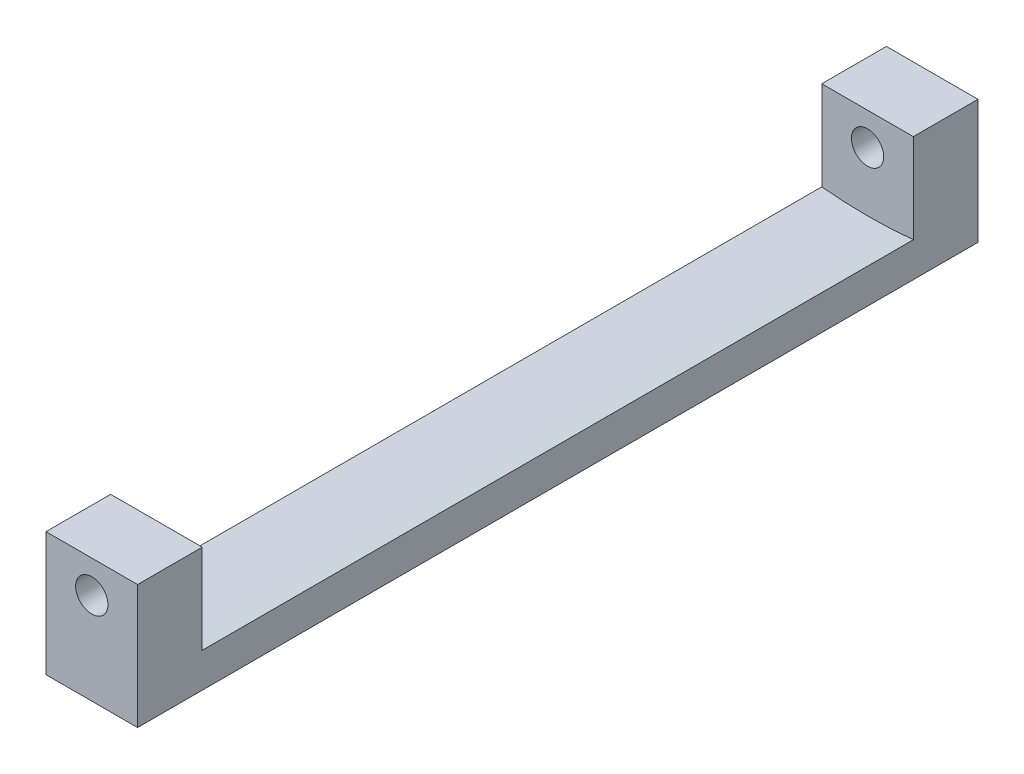
ISO-10303-21;
HEADER;
FILE_DESCRIPTION(('STEP AP214'),'2;1');
FILE_NAME('part.step','',(''),(''),'','','');
FILE_SCHEMA(('AUTOMOTIVE_DESIGN { 1 0 10303 214 1 1 1 1 }'));
ENDSEC;
DATA;
#1=APPLICATION_CONTEXT('core data for automotive mechanical design processes');
#2=APPLICATION_PROTOCOL_DEFINITION('international standard','automotive_design',2000,#1);
#3=PRODUCT_CONTEXT('',#1,'mechanical');
#4=PRODUCT('Part','Part','',(#3));
#5=PRODUCT_RELATED_PRODUCT_CATEGORY('part','',(#4));
#6=PRODUCT_DEFINITION_FORMATION('','',#4);
#7=PRODUCT_DEFINITION_CONTEXT('part definition',#1,'design');
#8=PRODUCT_DEFINITION('design','',#6,#7);
#9=PRODUCT_DEFINITION_SHAPE('','',#8);
#10=(LENGTH_UNIT() NAMED_UNIT(*) SI_UNIT(.MILLI.,.METRE.));
#11=(NAMED_UNIT(*) PLANE_ANGLE_UNIT() SI_UNIT($,.RADIAN.));
#12=(NAMED_UNIT(*) SI_UNIT($,.STERADIAN.) SOLID_ANGLE_UNIT());
#13=UNCERTAINTY_MEASURE_WITH_UNIT(LENGTH_MEASURE(1.E-05),#10,'distance_accuracy_value','');
#14=(GEOMETRIC_REPRESENTATION_CONTEXT(3) GLOBAL_UNCERTAINTY_ASSIGNED_CONTEXT((#13)) GLOBAL_UNIT_ASSIGNED_CONTEXT((#10,
#11,#12)) REPRESENTATION_CONTEXT('',''));
#15=CARTESIAN_POINT('',(0.,0.,0.));
#16=DIRECTION('',(0.,0.,1.));
#17=DIRECTION('',(1.,0.,0.));
#18=AXIS2_PLACEMENT_3D('',#15,#16,#17);
#19=CARTESIAN_POINT('',(0.,-45.5,78.));
#20=DIRECTION('',(0.,1.,0.));
#21=DIRECTION('',(0.,0.,1.));
#22=AXIS2_PLACEMENT_3D('',#19,#20,#21);
#23=PLANE('',#22);
#24=DIRECTION('',(1.,0.,0.));
#25=VECTOR('',#24,1.);
#26=CARTESIAN_POINT('',(0.,-45.5,0.));
#27=LINE('',#26,#25);
#28=CARTESIAN_POINT('',(-4.24999999999999,-45.5,0.));
#29=VERTEX_POINT('',#28);
#30=CARTESIAN_POINT('',(4.25000000000001,-45.5,0.));
#31=VERTEX_POINT('',#30);
#32=EDGE_CURVE('E172',#29,#31,#27,.T.);
#33=ORIENTED_EDGE('',*,*,#32,.T.);
#34=DIRECTION('',(0.,0.,-1.));
#35=VECTOR('',#34,1.);
#36=CARTESIAN_POINT('',(4.25000000000001,-45.5,78.));
#37=LINE('',#36,#35);
#38=CARTESIAN_POINT('',(4.25000000000001,-45.5,78.));
#39=VERTEX_POINT('',#38);
#40=EDGE_CURVE('E11',#39,#31,#37,.T.);
#41=ORIENTED_EDGE('',*,*,#40,.F.);
#42=DIRECTION('',(1.,0.,0.));
#43=VECTOR('',#42,1.);
#44=CARTESIAN_POINT('',(0.,-45.5,78.));
#45=LINE('',#44,#43);
#46=CARTESIAN_POINT('',(-4.24999999999999,-45.5,78.));
#47=VERTEX_POINT('',#46);
#48=EDGE_CURVE('E173',#47,#39,#45,.T.);
#49=ORIENTED_EDGE('',*,*,#48,.F.);
#50=DIRECTION('',(0.,0.,-1.));
#51=VECTOR('',#50,1.);
#52=CARTESIAN_POINT('',(-4.24999999999999,-45.5,78.));
#53=LINE('',#52,#51);
#54=EDGE_CURVE('E184',#47,#29,#53,.T.);
#55=ORIENTED_EDGE('',*,*,#54,.T.);
#56=EDGE_LOOP('',(#33,#41,#49,#55));
#57=FACE_BOUND('',#56,.T.);
#58=ADVANCED_FACE('F43',(#57),#23,.F.);
#59=CARTESIAN_POINT('',(4.25000000000001,0.,78.));
#60=DIRECTION('',(-1.,0.,0.));
#61=DIRECTION('',(0.,0.,1.));
#62=AXIS2_PLACEMENT_3D('',#59,#60,#61);
#63=PLANE('',#62);
#64=DIRECTION('',(0.,-1.,0.));
#65=VECTOR('',#64,1.);
#66=CARTESIAN_POINT('',(4.25000000000001,-34.,6.));
#67=LINE('',#66,#65);
#68=CARTESIAN_POINT('',(4.25000000000001,-34.,6.));
#69=VERTEX_POINT('',#68);
#70=CARTESIAN_POINT('',(4.25000000000001,-42.2869660770313,6.));
#71=VERTEX_POINT('',#70);
#72=EDGE_CURVE('E119',#69,#71,#67,.T.);
#73=ORIENTED_EDGE('',*,*,#72,.T.);
#74=DIRECTION('',(0.,0.,-1.));
#75=VECTOR('',#74,1.);
#76=CARTESIAN_POINT('',(4.25000000000001,-42.2869660770313,78.));
#77=LINE('',#76,#75);
#78=CARTESIAN_POINT('',(4.25000000000001,-42.2869660770313,72.));
#79=VERTEX_POINT('',#78);
#80=EDGE_CURVE('E52',#79,#71,#77,.T.);
#81=ORIENTED_EDGE('',*,*,#80,.F.);
#82=DIRECTION('',(0.,-1.,0.));
#83=VECTOR('',#82,1.);
#84=CARTESIAN_POINT('',(4.25000000000001,-34.,72.));
#85=LINE('',#84,#83);
#86=CARTESIAN_POINT('',(4.25000000000001,-34.,72.));
#87=VERTEX_POINT('',#86);
#88=EDGE_CURVE('E165',#87,#79,#85,.T.);
#89=ORIENTED_EDGE('',*,*,#88,.F.);
#90=DIRECTION('',(0.,0.,1.));
#91=VECTOR('',#90,1.);
#92=CARTESIAN_POINT('',(4.25000000000001,-34.,78.));
#93=LINE('',#92,#91);
#94=CARTESIAN_POINT('',(4.25000000000001,-34.,78.));
#95=VERTEX_POINT('',#94);
#96=EDGE_CURVE('E148',#87,#95,#93,.T.);
#97=ORIENTED_EDGE('',*,*,#96,.T.);
#98=DIRECTION('',(0.,1.,0.));
#99=VECTOR('',#98,1.);
#100=CARTESIAN_POINT('',(4.25000000000001,0.,78.));
#101=LINE('',#100,#99);
#102=EDGE_CURVE('E177',#39,#95,#101,.T.);
#103=ORIENTED_EDGE('',*,*,#102,.F.);
#104=ORIENTED_EDGE('',*,*,#40,.T.);
#105=DIRECTION('',(0.,1.,0.));
#106=VECTOR('',#105,1.);
#107=CARTESIAN_POINT('',(4.25000000000001,0.,0.));
#108=LINE('',#107,#106);
#109=CARTESIAN_POINT('',(4.25000000000001,-34.,0.));
#110=VERTEX_POINT('',#109);
#111=EDGE_CURVE('E188',#31,#110,#108,.T.);
#112=ORIENTED_EDGE('',*,*,#111,.T.);
#113=DIRECTION('',(0.,0.,1.));
#114=VECTOR('',#113,1.);
#115=CARTESIAN_POINT('',(4.25000000000001,-34.,0.));
#116=LINE('',#115,#114);
#117=EDGE_CURVE('E137',#110,#69,#116,.T.);
#118=ORIENTED_EDGE('',*,*,#117,.T.);
#119=EDGE_LOOP('',(#73,#81,#89,#97,#103,#104,#112,#118));
#120=FACE_BOUND('',#119,.T.);
#121=ADVANCED_FACE('F200',(#120),#63,.F.);
#122=CARTESIAN_POINT('',(0.,0.,78.));
#123=DIRECTION('',(0.,0.,-1.));
#124=DIRECTION('',(-1.,0.,0.));
#125=AXIS2_PLACEMENT_3D('',#122,#123,#124);
#126=CYLINDRICAL_SURFACE('',#125,42.5);
#127=CARTESIAN_POINT('',(0.,0.,6.00000000000001));
#128=DIRECTION('',(0.,0.,1.));
#129=DIRECTION('',(1.,0.,0.));
#130=AXIS2_PLACEMENT_3D('',#127,#128,#129);
#131=CIRCLE('',#130,42.5);
#132=CARTESIAN_POINT('',(-4.25,-42.2869660770314,6.));
#133=VERTEX_POINT('',#132);
#134=EDGE_CURVE('E131',#133,#71,#131,.T.);
#135=ORIENTED_EDGE('',*,*,#134,.F.);
#136=DIRECTION('',(0.,0.,-1.));
#137=VECTOR('',#136,1.);
#138=CARTESIAN_POINT('',(-4.24999999999999,-42.2869660770314,78.));
#139=LINE('',#138,#137);
#140=CARTESIAN_POINT('',(-4.24999999999999,-42.2869660770314,72.));
#141=VERTEX_POINT('',#140);
#142=EDGE_CURVE('E114',#141,#133,#139,.T.);
#143=ORIENTED_EDGE('',*,*,#142,.F.);
#144=CARTESIAN_POINT('',(0.,0.,72.));
#145=DIRECTION('',(0.,0.,-1.));
#146=DIRECTION('',(-1.,0.,0.));
#147=AXIS2_PLACEMENT_3D('',#144,#145,#146);
#148=CIRCLE('',#147,42.5);
#149=EDGE_CURVE('E59',#79,#141,#148,.T.);
#150=ORIENTED_EDGE('',*,*,#149,.F.);
#151=ORIENTED_EDGE('',*,*,#80,.T.);
#152=EDGE_LOOP('',(#135,#143,#150,#151));
#153=FACE_BOUND('',#152,.T.);
#154=ADVANCED_FACE('F198',(#153),#126,.F.);
#155=CARTESIAN_POINT('',(-4.24999999999999,0.,78.));
#156=DIRECTION('',(-1.,0.,0.));
#157=DIRECTION('',(0.,0.,1.));
#158=AXIS2_PLACEMENT_3D('',#155,#156,#157);
#159=PLANE('',#158);
#160=ORIENTED_EDGE('',*,*,#142,.T.);
#161=DIRECTION('',(0.,-1.,0.));
#162=VECTOR('',#161,1.);
#163=CARTESIAN_POINT('',(-4.25,-34.,6.));
#164=LINE('',#163,#162);
#165=CARTESIAN_POINT('',(-4.25,-34.,6.));
#166=VERTEX_POINT('',#165);
#167=EDGE_CURVE('E108',#166,#133,#164,.T.);
#168=ORIENTED_EDGE('',*,*,#167,.F.);
#169=DIRECTION('',(0.,0.,-1.));
#170=VECTOR('',#169,1.);
#171=CARTESIAN_POINT('',(-4.24999999999999,-34.,0.));
#172=LINE('',#171,#170);
#173=CARTESIAN_POINT('',(-4.24999999999999,-34.,0.));
#174=VERTEX_POINT('',#173);
#175=EDGE_CURVE('E112',#166,#174,#172,.T.);
#176=ORIENTED_EDGE('',*,*,#175,.T.);
#177=DIRECTION('',(0.,1.,0.));
#178=VECTOR('',#177,1.);
#179=CARTESIAN_POINT('',(-4.24999999999999,0.,0.));
#180=LINE('',#179,#178);
#181=EDGE_CURVE('E178',#29,#174,#180,.T.);
#182=ORIENTED_EDGE('',*,*,#181,.F.);
#183=ORIENTED_EDGE('',*,*,#54,.F.);
#184=DIRECTION('',(0.,1.,0.));
#185=VECTOR('',#184,1.);
#186=CARTESIAN_POINT('',(-4.24999999999999,0.,78.));
#187=LINE('',#186,#185);
#188=CARTESIAN_POINT('',(-4.24999999999999,-34.,78.));
#189=VERTEX_POINT('',#188);
#190=EDGE_CURVE('E181',#47,#189,#187,.T.);
#191=ORIENTED_EDGE('',*,*,#190,.T.);
#192=DIRECTION('',(0.,0.,-1.));
#193=VECTOR('',#192,1.);
#194=CARTESIAN_POINT('',(-4.24999999999999,-34.,78.));
#195=LINE('',#194,#193);
#196=CARTESIAN_POINT('',(-4.24999999999999,-34.,72.));
#197=VERTEX_POINT('',#196);
#198=EDGE_CURVE('E156',#189,#197,#195,.T.);
#199=ORIENTED_EDGE('',*,*,#198,.T.);
#200=DIRECTION('',(0.,-1.,0.));
#201=VECTOR('',#200,1.);
#202=CARTESIAN_POINT('',(-4.24999999999999,-34.,72.));
#203=LINE('',#202,#201);
#204=EDGE_CURVE('E164',#197,#141,#203,.T.);
#205=ORIENTED_EDGE('',*,*,#204,.T.);
#206=EDGE_LOOP('',(#160,#168,#176,#182,#183,#191,#199,#205));
#207=FACE_BOUND('',#206,.T.);
#208=ADVANCED_FACE('F110',(#207),#159,.T.);
#209=CARTESIAN_POINT('',(0.,0.,78.));
#210=DIRECTION('',(0.,0.,1.));
#211=DIRECTION('',(1.,0.,0.));
#212=AXIS2_PLACEMENT_3D('',#209,#210,#211);
#213=PLANE('',#212);
#214=CARTESIAN_POINT('',(0.,-37.,78.));
#215=DIRECTION('',(0.,0.,1.));
#216=DIRECTION('',(1.,0.,0.));
#217=AXIS2_PLACEMENT_3D('',#214,#215,#216);
#218=CIRCLE('',#217,1.5);
#219=CARTESIAN_POINT('',(1.5,-37.,78.));
#220=VERTEX_POINT('',#219);
#221=EDGE_CURVE('E120',#220,#220,#218,.T.);
#222=ORIENTED_EDGE('',*,*,#221,.F.);
#223=EDGE_LOOP('',(#222));
#224=FACE_BOUND('',#223,.T.);
#225=DIRECTION('',(-1.,0.,0.));
#226=VECTOR('',#225,1.);
#227=CARTESIAN_POINT('',(4.25000000000001,-34.,78.));
#228=LINE('',#227,#226);
#229=EDGE_CURVE('E152',#95,#189,#228,.T.);
#230=ORIENTED_EDGE('',*,*,#229,.T.);
#231=ORIENTED_EDGE('',*,*,#190,.F.);
#232=ORIENTED_EDGE('',*,*,#48,.T.);
#233=ORIENTED_EDGE('',*,*,#102,.T.);
#234=EDGE_LOOP('',(#230,#231,#232,#233));
#235=FACE_BOUND('',#234,.T.);
#236=ADVANCED_FACE('F212',(#224,#235),#213,.T.);
#237=CARTESIAN_POINT('',(0.,0.,0.));
#238=DIRECTION('',(0.,0.,1.));
#239=DIRECTION('',(1.,0.,0.));
#240=AXIS2_PLACEMENT_3D('',#237,#238,#239);
#241=PLANE('',#240);
#242=CARTESIAN_POINT('',(0.,-37.,0.));
#243=DIRECTION('',(0.,0.,-1.));
#244=DIRECTION('',(-1.,0.,0.));
#245=AXIS2_PLACEMENT_3D('',#242,#243,#244);
#246=CIRCLE('',#245,1.5);
#247=CARTESIAN_POINT('',(-1.5,-37.,0.));
#248=VERTEX_POINT('',#247);
#249=EDGE_CURVE('E382',#248,#248,#246,.T.);
#250=ORIENTED_EDGE('',*,*,#249,.F.);
#251=EDGE_LOOP('',(#250));
#252=FACE_BOUND('',#251,.T.);
#253=DIRECTION('',(1.,0.,0.));
#254=VECTOR('',#253,1.);
#255=CARTESIAN_POINT('',(-4.24999999999999,-34.,0.));
#256=LINE('',#255,#254);
#257=EDGE_CURVE('E129',#174,#110,#256,.T.);
#258=ORIENTED_EDGE('',*,*,#257,.T.);
#259=ORIENTED_EDGE('',*,*,#111,.F.);
#260=ORIENTED_EDGE('',*,*,#32,.F.);
#261=ORIENTED_EDGE('',*,*,#181,.T.);
#262=EDGE_LOOP('',(#258,#259,#260,#261));
#263=FACE_BOUND('',#262,.T.);
#264=ADVANCED_FACE('F216',(#252,#263),#241,.F.);
#265=CARTESIAN_POINT('',(4.25000000000001,-34.,72.));
#266=DIRECTION('',(0.,0.,-1.));
#267=DIRECTION('',(-1.,0.,0.));
#268=AXIS2_PLACEMENT_3D('',#265,#266,#267);
#269=PLANE('',#268);
#270=CARTESIAN_POINT('',(0.,-37.,72.));
#271=DIRECTION('',(0.,0.,-1.));
#272=DIRECTION('',(-1.,0.,0.));
#273=AXIS2_PLACEMENT_3D('',#270,#271,#272);
#274=CIRCLE('',#273,1.5);
#275=CARTESIAN_POINT('',(-1.5,-37.,72.));
#276=VERTEX_POINT('',#275);
#277=EDGE_CURVE('E375',#276,#276,#274,.T.);
#278=ORIENTED_EDGE('',*,*,#277,.F.);
#279=EDGE_LOOP('',(#278));
#280=FACE_BOUND('',#279,.T.);
#281=ORIENTED_EDGE('',*,*,#88,.T.);
#282=ORIENTED_EDGE('',*,*,#149,.T.);
#283=ORIENTED_EDGE('',*,*,#204,.F.);
#284=DIRECTION('',(1.,0.,0.));
#285=VECTOR('',#284,1.);
#286=CARTESIAN_POINT('',(4.25000000000001,-34.,72.));
#287=LINE('',#286,#285);
#288=EDGE_CURVE('E160',#197,#87,#287,.T.);
#289=ORIENTED_EDGE('',*,*,#288,.T.);
#290=EDGE_LOOP('',(#281,#282,#283,#289));
#291=FACE_BOUND('',#290,.T.);
#292=ADVANCED_FACE('F202',(#280,#291),#269,.T.);
#293=CARTESIAN_POINT('',(0.,-34.,0.));
#294=DIRECTION('',(0.,1.,0.));
#295=DIRECTION('',(0.,0.,1.));
#296=AXIS2_PLACEMENT_3D('',#293,#294,#295);
#297=PLANE('',#296);
#298=ORIENTED_EDGE('',*,*,#96,.F.);
#299=ORIENTED_EDGE('',*,*,#288,.F.);
#300=ORIENTED_EDGE('',*,*,#198,.F.);
#301=ORIENTED_EDGE('',*,*,#229,.F.);
#302=EDGE_LOOP('',(#298,#299,#300,#301));
#303=FACE_BOUND('',#302,.T.);
#304=ADVANCED_FACE('F206',(#303),#297,.T.);
#305=CARTESIAN_POINT('',(-4.25,-34.,6.));
#306=DIRECTION('',(0.,0.,1.));
#307=DIRECTION('',(1.,0.,0.));
#308=AXIS2_PLACEMENT_3D('',#305,#306,#307);
#309=PLANE('',#308);
#310=CARTESIAN_POINT('',(0.,-37.,6.00000000000001));
#311=DIRECTION('',(0.,0.,1.));
#312=DIRECTION('',(1.,0.,0.));
#313=AXIS2_PLACEMENT_3D('',#310,#311,#312);
#314=CIRCLE('',#313,1.5);
#315=CARTESIAN_POINT('',(1.5,-37.,6.00000000000001));
#316=VERTEX_POINT('',#315);
#317=EDGE_CURVE('E46',#316,#316,#314,.T.);
#318=ORIENTED_EDGE('',*,*,#317,.F.);
#319=EDGE_LOOP('',(#318));
#320=FACE_BOUND('',#319,.T.);
#321=ORIENTED_EDGE('',*,*,#167,.T.);
#322=ORIENTED_EDGE('',*,*,#134,.T.);
#323=ORIENTED_EDGE('',*,*,#72,.F.);
#324=DIRECTION('',(-1.,0.,0.));
#325=VECTOR('',#324,1.);
#326=CARTESIAN_POINT('',(-4.25,-34.,6.));
#327=LINE('',#326,#325);
#328=EDGE_CURVE('E127',#69,#166,#327,.T.);
#329=ORIENTED_EDGE('',*,*,#328,.T.);
#330=EDGE_LOOP('',(#321,#322,#323,#329));
#331=FACE_BOUND('',#330,.T.);
#332=ADVANCED_FACE('F133',(#320,#331),#309,.T.);
#333=CARTESIAN_POINT('',(0.,-34.,0.));
#334=DIRECTION('',(0.,1.,0.));
#335=DIRECTION('',(0.,0.,1.));
#336=AXIS2_PLACEMENT_3D('',#333,#334,#335);
#337=PLANE('',#336);
#338=ORIENTED_EDGE('',*,*,#175,.F.);
#339=ORIENTED_EDGE('',*,*,#328,.F.);
#340=ORIENTED_EDGE('',*,*,#117,.F.);
#341=ORIENTED_EDGE('',*,*,#257,.F.);
#342=EDGE_LOOP('',(#338,#339,#340,#341));
#343=FACE_BOUND('',#342,.T.);
#344=ADVANCED_FACE('F125',(#343),#337,.T.);
#345=CARTESIAN_POINT('',(0.,-37.,100.));
#346=DIRECTION('',(0.,0.,-1.));
#347=DIRECTION('',(-1.,0.,0.));
#348=AXIS2_PLACEMENT_3D('',#345,#346,#347);
#349=CYLINDRICAL_SURFACE('',#348,1.5);
#350=ORIENTED_EDGE('',*,*,#317,.T.);
#351=EDGE_LOOP('',(#350));
#352=FACE_BOUND('',#351,.T.);
#353=ORIENTED_EDGE('',*,*,#249,.T.);
#354=EDGE_LOOP('',(#353));
#355=FACE_BOUND('',#354,.T.);
#356=ADVANCED_FACE('F282',(#352,#355),#349,.F.);
#357=ORIENTED_EDGE('',*,*,#221,.T.);
#358=EDGE_LOOP('',(#357));
#359=FACE_BOUND('',#358,.T.);
#360=ORIENTED_EDGE('',*,*,#277,.T.);
#361=EDGE_LOOP('',(#360));
#362=FACE_BOUND('',#361,.T.);
#363=ADVANCED_FACE('F287',(#359,#362),#349,.F.);
#364=CLOSED_SHELL('',(#58,#121,#154,#208,#236,#264,#292,#304,#332,#344,#356,#363));
#365=MANIFOLD_SOLID_BREP('B2',#364);
#366=ADVANCED_BREP_SHAPE_REPRESENTATION('',(#18,#365),#14);
#367=SHAPE_DEFINITION_REPRESENTATION(#9,#366);
ENDSEC;
END-ISO-10303-21;
